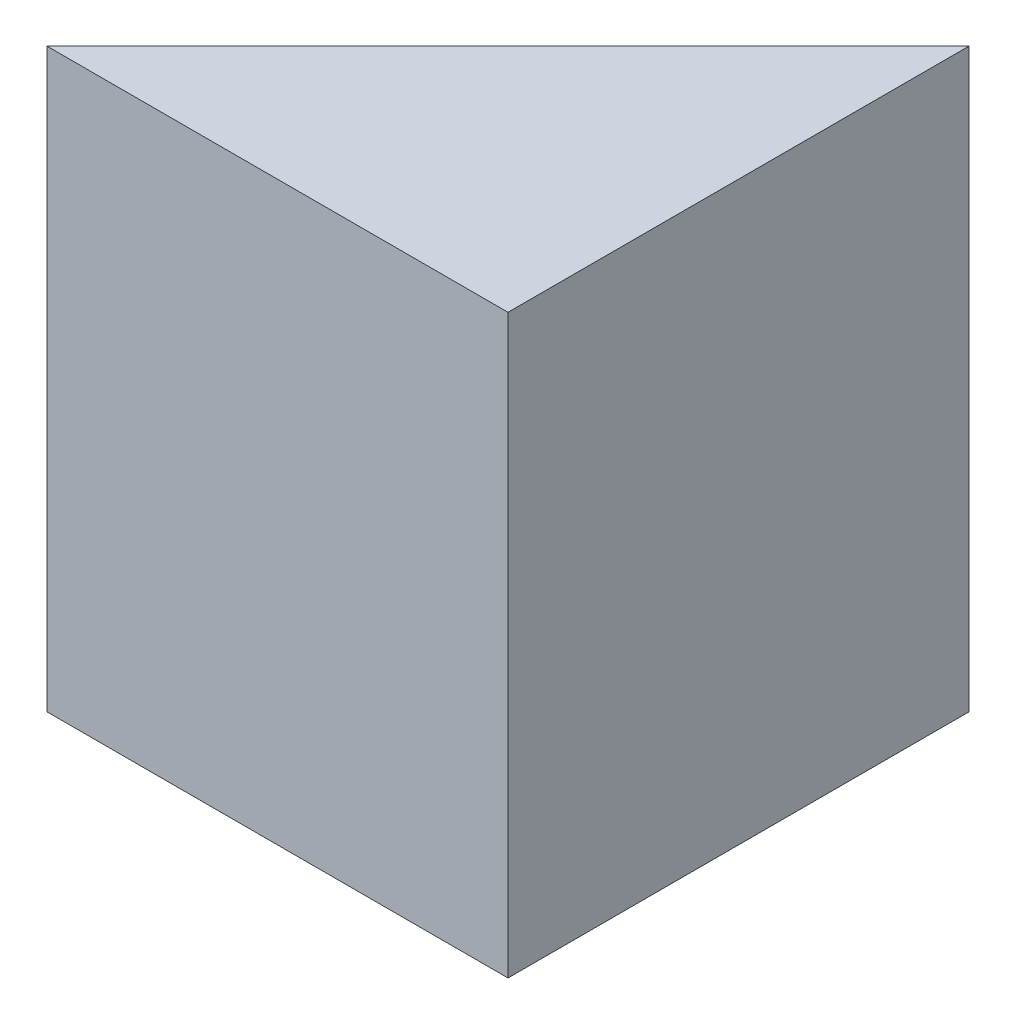
ISO-10303-21;
HEADER;
FILE_DESCRIPTION(('STEP AP214'),'2;1');
FILE_NAME('part.step','',(''),(''),'','','');
FILE_SCHEMA(('AUTOMOTIVE_DESIGN { 1 0 10303 214 1 1 1 1 }'));
ENDSEC;
DATA;
#1=APPLICATION_CONTEXT('core data for automotive mechanical design processes');
#2=APPLICATION_PROTOCOL_DEFINITION('international standard','automotive_design',2000,#1);
#3=PRODUCT_CONTEXT('',#1,'mechanical');
#4=PRODUCT('Part','Part','',(#3));
#5=PRODUCT_RELATED_PRODUCT_CATEGORY('part','',(#4));
#6=PRODUCT_DEFINITION_FORMATION('','',#4);
#7=PRODUCT_DEFINITION_CONTEXT('part definition',#1,'design');
#8=PRODUCT_DEFINITION('design','',#6,#7);
#9=PRODUCT_DEFINITION_SHAPE('','',#8);
#10=(LENGTH_UNIT() NAMED_UNIT(*) SI_UNIT(.MILLI.,.METRE.));
#11=(NAMED_UNIT(*) PLANE_ANGLE_UNIT() SI_UNIT($,.RADIAN.));
#12=(NAMED_UNIT(*) SI_UNIT($,.STERADIAN.) SOLID_ANGLE_UNIT());
#13=UNCERTAINTY_MEASURE_WITH_UNIT(LENGTH_MEASURE(1.E-05),#10,'distance_accuracy_value','');
#14=(GEOMETRIC_REPRESENTATION_CONTEXT(3) GLOBAL_UNCERTAINTY_ASSIGNED_CONTEXT((#13)) GLOBAL_UNIT_ASSIGNED_CONTEXT((#10,
#11,#12)) REPRESENTATION_CONTEXT('',''));
#15=CARTESIAN_POINT('',(0.,0.,0.));
#16=DIRECTION('',(0.,0.,1.));
#17=DIRECTION('',(1.,0.,0.));
#18=AXIS2_PLACEMENT_3D('',#15,#16,#17);
#19=CARTESIAN_POINT('',(40.,50.,-40.));
#20=DIRECTION('',(0.707106781186548,0.,0.707106781186548));
#21=DIRECTION('',(0.707106781186548,0.,-0.707106781186548));
#22=AXIS2_PLACEMENT_3D('',#19,#20,#21);
#23=PLANE('',#22);
#24=DIRECTION('',(-0.707106781186548,0.,0.707106781186548));
#25=VECTOR('',#24,1.);
#26=CARTESIAN_POINT('',(40.,0.,-40.));
#27=LINE('',#26,#25);
#28=CARTESIAN_POINT('',(40.,0.,-40.));
#29=VERTEX_POINT('',#28);
#30=CARTESIAN_POINT('',(0.,0.,0.));
#31=VERTEX_POINT('',#30);
#32=EDGE_CURVE('E91',#29,#31,#27,.T.);
#33=ORIENTED_EDGE('',*,*,#32,.T.);
#34=DIRECTION('',(0.,-1.,0.));
#35=VECTOR('',#34,1.);
#36=CARTESIAN_POINT('',(0.,50.,0.));
#37=LINE('',#36,#35);
#38=CARTESIAN_POINT('',(0.,50.,0.));
#39=VERTEX_POINT('',#38);
#40=EDGE_CURVE('E11',#39,#31,#37,.T.);
#41=ORIENTED_EDGE('',*,*,#40,.F.);
#42=DIRECTION('',(-0.707106781186548,0.,0.707106781186548));
#43=VECTOR('',#42,1.);
#44=CARTESIAN_POINT('',(40.,50.,-40.));
#45=LINE('',#44,#43);
#46=CARTESIAN_POINT('',(40.,50.,-40.));
#47=VERTEX_POINT('',#46);
#48=EDGE_CURVE('E83',#47,#39,#45,.T.);
#49=ORIENTED_EDGE('',*,*,#48,.F.);
#50=DIRECTION('',(0.,-1.,0.));
#51=VECTOR('',#50,1.);
#52=CARTESIAN_POINT('',(40.,50.,-40.));
#53=LINE('',#52,#51);
#54=EDGE_CURVE('E92',#47,#29,#53,.T.);
#55=ORIENTED_EDGE('',*,*,#54,.T.);
#56=EDGE_LOOP('',(#33,#41,#49,#55));
#57=FACE_BOUND('',#56,.T.);
#58=ADVANCED_FACE('F41',(#57),#23,.F.);
#59=CARTESIAN_POINT('',(0.,50.,0.));
#60=DIRECTION('',(0.,0.,-1.));
#61=DIRECTION('',(-1.,0.,0.));
#62=AXIS2_PLACEMENT_3D('',#59,#60,#61);
#63=PLANE('',#62);
#64=DIRECTION('',(1.,0.,0.));
#65=VECTOR('',#64,1.);
#66=CARTESIAN_POINT('',(0.,0.,0.));
#67=LINE('',#66,#65);
#68=CARTESIAN_POINT('',(40.,0.,0.));
#69=VERTEX_POINT('',#68);
#70=EDGE_CURVE('E70',#31,#69,#67,.T.);
#71=ORIENTED_EDGE('',*,*,#70,.T.);
#72=DIRECTION('',(0.,-1.,0.));
#73=VECTOR('',#72,1.);
#74=CARTESIAN_POINT('',(40.,50.,0.));
#75=LINE('',#74,#73);
#76=CARTESIAN_POINT('',(40.,50.,0.));
#77=VERTEX_POINT('',#76);
#78=EDGE_CURVE('E50',#77,#69,#75,.T.);
#79=ORIENTED_EDGE('',*,*,#78,.F.);
#80=DIRECTION('',(1.,0.,0.));
#81=VECTOR('',#80,1.);
#82=CARTESIAN_POINT('',(0.,50.,0.));
#83=LINE('',#82,#81);
#84=EDGE_CURVE('E78',#39,#77,#83,.T.);
#85=ORIENTED_EDGE('',*,*,#84,.F.);
#86=ORIENTED_EDGE('',*,*,#40,.T.);
#87=EDGE_LOOP('',(#71,#79,#85,#86));
#88=FACE_BOUND('',#87,.T.);
#89=ADVANCED_FACE('F79',(#88),#63,.F.);
#90=CARTESIAN_POINT('',(40.,50.,0.));
#91=DIRECTION('',(-1.,0.,0.));
#92=DIRECTION('',(0.,0.,1.));
#93=AXIS2_PLACEMENT_3D('',#90,#91,#92);
#94=PLANE('',#93);
#95=DIRECTION('',(0.,0.,-1.));
#96=VECTOR('',#95,1.);
#97=CARTESIAN_POINT('',(40.,0.,0.));
#98=LINE('',#97,#96);
#99=EDGE_CURVE('E75',#69,#29,#98,.T.);
#100=ORIENTED_EDGE('',*,*,#99,.T.);
#101=ORIENTED_EDGE('',*,*,#54,.F.);
#102=DIRECTION('',(0.,0.,-1.));
#103=VECTOR('',#102,1.);
#104=CARTESIAN_POINT('',(40.,50.,0.));
#105=LINE('',#104,#103);
#106=EDGE_CURVE('E58',#77,#47,#105,.T.);
#107=ORIENTED_EDGE('',*,*,#106,.F.);
#108=ORIENTED_EDGE('',*,*,#78,.T.);
#109=EDGE_LOOP('',(#100,#101,#107,#108));
#110=FACE_BOUND('',#109,.T.);
#111=ADVANCED_FACE('F104',(#110),#94,.F.);
#112=CARTESIAN_POINT('',(0.,50.,0.));
#113=DIRECTION('',(0.,1.,0.));
#114=DIRECTION('',(0.,0.,1.));
#115=AXIS2_PLACEMENT_3D('',#112,#113,#114);
#116=PLANE('',#115);
#117=ORIENTED_EDGE('',*,*,#48,.T.);
#118=ORIENTED_EDGE('',*,*,#84,.T.);
#119=ORIENTED_EDGE('',*,*,#106,.T.);
#120=EDGE_LOOP('',(#117,#118,#119));
#121=FACE_BOUND('',#120,.T.);
#122=ADVANCED_FACE('F86',(#121),#116,.T.);
#123=CARTESIAN_POINT('',(0.,0.,0.));
#124=DIRECTION('',(0.,1.,0.));
#125=DIRECTION('',(0.,0.,1.));
#126=AXIS2_PLACEMENT_3D('',#123,#124,#125);
#127=PLANE('',#126);
#128=ORIENTED_EDGE('',*,*,#32,.F.);
#129=ORIENTED_EDGE('',*,*,#99,.F.);
#130=ORIENTED_EDGE('',*,*,#70,.F.);
#131=EDGE_LOOP('',(#128,#129,#130));
#132=FACE_BOUND('',#131,.T.);
#133=ADVANCED_FACE('F105',(#132),#127,.F.);
#134=CLOSED_SHELL('',(#58,#89,#111,#122,#133));
#135=MANIFOLD_SOLID_BREP('B2',#134);
#136=ADVANCED_BREP_SHAPE_REPRESENTATION('',(#18,#135),#14);
#137=SHAPE_DEFINITION_REPRESENTATION(#9,#136);
ENDSEC;
END-ISO-10303-21;
